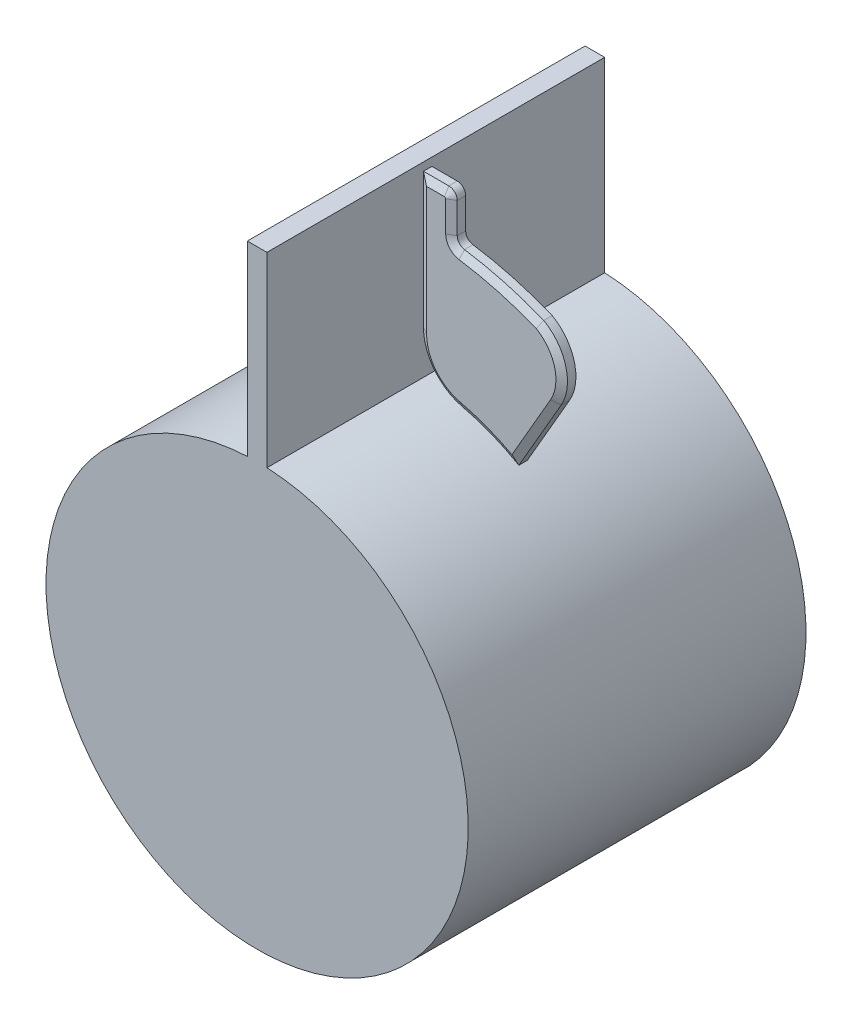
ISO-10303-21;
HEADER;
FILE_DESCRIPTION(('STEP AP214'),'2;1');
FILE_NAME('part.step','',(''),(''),'','','');
FILE_SCHEMA(('AUTOMOTIVE_DESIGN { 1 0 10303 214 1 1 1 1 }'));
ENDSEC;
DATA;
#1=APPLICATION_CONTEXT('core data for automotive mechanical design processes');
#2=APPLICATION_PROTOCOL_DEFINITION('international standard','automotive_design',2000,#1);
#3=PRODUCT_CONTEXT('',#1,'mechanical');
#4=PRODUCT('Part','Part','',(#3));
#5=PRODUCT_RELATED_PRODUCT_CATEGORY('part','',(#4));
#6=PRODUCT_DEFINITION_FORMATION('','',#4);
#7=PRODUCT_DEFINITION_CONTEXT('part definition',#1,'design');
#8=PRODUCT_DEFINITION('design','',#6,#7);
#9=PRODUCT_DEFINITION_SHAPE('','',#8);
#10=(LENGTH_UNIT() NAMED_UNIT(*) SI_UNIT(.MILLI.,.METRE.));
#11=(NAMED_UNIT(*) PLANE_ANGLE_UNIT() SI_UNIT($,.RADIAN.));
#12=(NAMED_UNIT(*) SI_UNIT($,.STERADIAN.) SOLID_ANGLE_UNIT());
#13=UNCERTAINTY_MEASURE_WITH_UNIT(LENGTH_MEASURE(1.E-05),#10,'distance_accuracy_value','');
#14=(GEOMETRIC_REPRESENTATION_CONTEXT(3) GLOBAL_UNCERTAINTY_ASSIGNED_CONTEXT((#13)) GLOBAL_UNIT_ASSIGNED_CONTEXT((#10,
#11,#12)) REPRESENTATION_CONTEXT('',''));
#15=CARTESIAN_POINT('',(0.,0.,0.));
#16=DIRECTION('',(0.,0.,1.));
#17=DIRECTION('',(1.,0.,0.));
#18=AXIS2_PLACEMENT_3D('',#15,#16,#17);
#19=CARTESIAN_POINT('',(0.,0.,63.5));
#20=DIRECTION('',(0.,0.,-1.));
#21=DIRECTION('',(-1.,0.,0.));
#22=AXIS2_PLACEMENT_3D('',#19,#20,#21);
#23=CYLINDRICAL_SURFACE('',#22,79.375);
#24=CARTESIAN_POINT('',(0.,0.,-63.5));
#25=DIRECTION('',(0.,0.,1.));
#26=DIRECTION('',(1.,0.,0.));
#27=AXIS2_PLACEMENT_3D('',#24,#25,#26);
#28=CIRCLE('',#27,79.375);
#29=CARTESIAN_POINT('',(-3.68299999999999,79.289508360186,-63.5));
#30=VERTEX_POINT('',#29);
#31=CARTESIAN_POINT('',(3.68300000000003,79.289508360186,-63.5));
#32=VERTEX_POINT('',#31);
#33=EDGE_CURVE('E122',#30,#32,#28,.T.);
#34=ORIENTED_EDGE('',*,*,#33,.T.);
#35=DIRECTION('',(0.,0.,-1.));
#36=VECTOR('',#35,1.);
#37=CARTESIAN_POINT('',(3.68300000000003,79.289508360186,63.5));
#38=LINE('',#37,#36);
#39=CARTESIAN_POINT('',(3.68300000000003,79.289508360186,63.5));
#40=VERTEX_POINT('',#39);
#41=EDGE_CURVE('E12',#40,#32,#38,.T.);
#42=ORIENTED_EDGE('',*,*,#41,.F.);
#43=CARTESIAN_POINT('',(0.,0.,63.5));
#44=DIRECTION('',(0.,0.,1.));
#45=DIRECTION('',(1.,0.,0.));
#46=AXIS2_PLACEMENT_3D('',#43,#44,#45);
#47=CIRCLE('',#46,79.375);
#48=CARTESIAN_POINT('',(-3.68299999999999,79.289508360186,63.5));
#49=VERTEX_POINT('',#48);
#50=EDGE_CURVE('E110',#49,#40,#47,.T.);
#51=ORIENTED_EDGE('',*,*,#50,.F.);
#52=DIRECTION('',(0.,0.,-1.));
#53=VECTOR('',#52,1.);
#54=CARTESIAN_POINT('',(-3.68299999999999,79.289508360186,63.5));
#55=LINE('',#54,#53);
#56=EDGE_CURVE('E118',#49,#30,#55,.T.);
#57=ORIENTED_EDGE('',*,*,#56,.T.);
#58=EDGE_LOOP('',(#34,#42,#51,#57));
#59=FACE_BOUND('',#58,.T.);
#60=ADVANCED_FACE('F59',(#59),#23,.T.);
#61=CARTESIAN_POINT('',(3.683,149.441811306485,63.5));
#62=DIRECTION('',(-1.,0.,0.));
#63=DIRECTION('',(0.,-1.,0.));
#64=AXIS2_PLACEMENT_3D('',#61,#62,#63);
#65=PLANE('',#64);
#66=DIRECTION('',(0.,1.,0.));
#67=VECTOR('',#66,1.);
#68=CARTESIAN_POINT('',(3.683,149.441811306485,-63.5));
#69=LINE('',#68,#67);
#70=CARTESIAN_POINT('',(3.683,149.441811306485,-63.5));
#71=VERTEX_POINT('',#70);
#72=EDGE_CURVE('E114',#32,#71,#69,.T.);
#73=ORIENTED_EDGE('',*,*,#72,.T.);
#74=DIRECTION('',(0.,0.,-1.));
#75=VECTOR('',#74,1.);
#76=CARTESIAN_POINT('',(3.683,149.441811306485,63.5));
#77=LINE('',#76,#75);
#78=CARTESIAN_POINT('',(3.683,149.441811306485,63.5));
#79=VERTEX_POINT('',#78);
#80=EDGE_CURVE('E67',#79,#71,#77,.T.);
#81=ORIENTED_EDGE('',*,*,#80,.F.);
#82=DIRECTION('',(0.,1.,0.));
#83=VECTOR('',#82,1.);
#84=CARTESIAN_POINT('',(3.683,149.441811306485,63.5));
#85=LINE('',#84,#83);
#86=EDGE_CURVE('E105',#40,#79,#85,.T.);
#87=ORIENTED_EDGE('',*,*,#86,.F.);
#88=ORIENTED_EDGE('',*,*,#41,.T.);
#89=EDGE_LOOP('',(#73,#81,#87,#88));
#90=FACE_BOUND('',#89,.T.);
#91=ADVANCED_FACE('F113',(#90),#65,.F.);
#92=CARTESIAN_POINT('',(3.683,149.441811306485,63.5));
#93=DIRECTION('',(0.,-1.,0.));
#94=DIRECTION('',(0.,0.,-1.));
#95=AXIS2_PLACEMENT_3D('',#92,#93,#94);
#96=PLANE('',#95);
#97=DIRECTION('',(-1.,0.,0.));
#98=VECTOR('',#97,1.);
#99=CARTESIAN_POINT('',(3.683,149.441811306485,-63.5));
#100=LINE('',#99,#98);
#101=CARTESIAN_POINT('',(-3.683,149.441811306485,-63.5));
#102=VERTEX_POINT('',#101);
#103=EDGE_CURVE('E92',#71,#102,#100,.T.);
#104=ORIENTED_EDGE('',*,*,#103,.T.);
#105=DIRECTION('',(0.,0.,-1.));
#106=VECTOR('',#105,1.);
#107=CARTESIAN_POINT('',(-3.683,149.441811306485,63.5));
#108=LINE('',#107,#106);
#109=CARTESIAN_POINT('',(-3.683,149.441811306485,63.5));
#110=VERTEX_POINT('',#109);
#111=EDGE_CURVE('E115',#110,#102,#108,.T.);
#112=ORIENTED_EDGE('',*,*,#111,.F.);
#113=DIRECTION('',(-1.,0.,0.));
#114=VECTOR('',#113,1.);
#115=CARTESIAN_POINT('',(3.683,149.441811306485,63.5));
#116=LINE('',#115,#114);
#117=EDGE_CURVE('E108',#79,#110,#116,.T.);
#118=ORIENTED_EDGE('',*,*,#117,.F.);
#119=ORIENTED_EDGE('',*,*,#80,.T.);
#120=EDGE_LOOP('',(#104,#112,#118,#119));
#121=FACE_BOUND('',#120,.T.);
#122=ADVANCED_FACE('F116',(#121),#96,.F.);
#123=CARTESIAN_POINT('',(-3.683,149.441811306485,63.5));
#124=DIRECTION('',(1.,0.,0.));
#125=DIRECTION('',(0.,1.,0.));
#126=AXIS2_PLACEMENT_3D('',#123,#124,#125);
#127=PLANE('',#126);
#128=DIRECTION('',(0.,-1.,0.));
#129=VECTOR('',#128,1.);
#130=CARTESIAN_POINT('',(-3.683,149.441811306485,-63.5));
#131=LINE('',#130,#129);
#132=EDGE_CURVE('E98',#102,#30,#131,.T.);
#133=ORIENTED_EDGE('',*,*,#132,.T.);
#134=ORIENTED_EDGE('',*,*,#56,.F.);
#135=DIRECTION('',(0.,-1.,0.));
#136=VECTOR('',#135,1.);
#137=CARTESIAN_POINT('',(-3.683,149.441811306485,63.5));
#138=LINE('',#137,#136);
#139=EDGE_CURVE('E75',#110,#49,#138,.T.);
#140=ORIENTED_EDGE('',*,*,#139,.F.);
#141=ORIENTED_EDGE('',*,*,#111,.T.);
#142=EDGE_LOOP('',(#133,#134,#140,#141));
#143=FACE_BOUND('',#142,.T.);
#144=ADVANCED_FACE('F129',(#143),#127,.F.);
#145=CARTESIAN_POINT('',(0.,0.,63.5));
#146=DIRECTION('',(0.,0.,1.));
#147=DIRECTION('',(1.,0.,0.));
#148=AXIS2_PLACEMENT_3D('',#145,#146,#147);
#149=PLANE('',#148);
#150=ORIENTED_EDGE('',*,*,#50,.T.);
#151=ORIENTED_EDGE('',*,*,#86,.T.);
#152=ORIENTED_EDGE('',*,*,#117,.T.);
#153=ORIENTED_EDGE('',*,*,#139,.T.);
#154=EDGE_LOOP('',(#150,#151,#152,#153));
#155=FACE_BOUND('',#154,.T.);
#156=ADVANCED_FACE('F106',(#155),#149,.T.);
#157=CARTESIAN_POINT('',(0.,0.,-63.5));
#158=DIRECTION('',(0.,0.,1.));
#159=DIRECTION('',(1.,0.,0.));
#160=AXIS2_PLACEMENT_3D('',#157,#158,#159);
#161=PLANE('',#160);
#162=ORIENTED_EDGE('',*,*,#33,.F.);
#163=ORIENTED_EDGE('',*,*,#132,.F.);
#164=ORIENTED_EDGE('',*,*,#103,.F.);
#165=ORIENTED_EDGE('',*,*,#72,.F.);
#166=EDGE_LOOP('',(#162,#163,#164,#165));
#167=FACE_BOUND('',#166,.T.);
#168=ADVANCED_FACE('F132',(#167),#161,.F.);
#169=CLOSED_SHELL('',(#60,#91,#122,#144,#156,#168));
#170=MANIFOLD_SOLID_BREP('B2_NOT_SHOWN',#169);
#171=CARTESIAN_POINT('',(0.,0.,6.35));
#172=DIRECTION('',(-0.866025403784442,0.499999999999994,0.));
#173=DIRECTION('',(-0.499999999999994,-0.866025403784442,0.));
#174=AXIS2_PLACEMENT_3D('',#171,#172,#173);
#175=PLANE('',#174);
#176=DIRECTION('',(0.,0.,-1.));
#177=VECTOR('',#176,1.);
#178=CARTESIAN_POINT('',(39.6874999999995,68.7407664253901,6.35));
#179=LINE('',#178,#177);
#180=CARTESIAN_POINT('',(39.6874999999995,68.7407664253901,4.76249964031978));
#181=VERTEX_POINT('',#180);
#182=CARTESIAN_POINT('',(39.6874999999995,68.7407664253901,1.58750035968022));
#183=VERTEX_POINT('',#182);
#184=EDGE_CURVE('E469',#181,#183,#179,.T.);
#185=ORIENTED_EDGE('',*,*,#184,.T.);
#186=DIRECTION('',(0.499999999999994,0.866025403784442,0.));
#187=VECTOR('',#186,1.);
#188=CARTESIAN_POINT('',(0.,0.,1.58750035968022));
#189=LINE('',#188,#187);
#190=CARTESIAN_POINT('',(55.5624999999993,96.2370729955462,1.58750035968022));
#191=VERTEX_POINT('',#190);
#192=EDGE_CURVE('E57',#183,#191,#189,.T.);
#193=ORIENTED_EDGE('',*,*,#192,.T.);
#194=DIRECTION('',(0.,0.,-1.));
#195=VECTOR('',#194,1.);
#196=CARTESIAN_POINT('',(55.5624999999993,96.2370729955462,6.35));
#197=LINE('',#196,#195);
#198=CARTESIAN_POINT('',(55.5624999999993,96.2370729955462,4.76249964031978));
#199=VERTEX_POINT('',#198);
#200=EDGE_CURVE('E359',#199,#191,#197,.T.);
#201=ORIENTED_EDGE('',*,*,#200,.F.);
#202=DIRECTION('',(-0.499999999999994,-0.866025403784442,0.));
#203=VECTOR('',#202,1.);
#204=CARTESIAN_POINT('',(39.6874999999995,68.7407664253901,4.76249964031978));
#205=LINE('',#204,#203);
#206=EDGE_CURVE('E398',#199,#181,#205,.T.);
#207=ORIENTED_EDGE('',*,*,#206,.T.);
#208=EDGE_LOOP('',(#185,#193,#201,#207));
#209=FACE_BOUND('',#208,.T.);
#210=ADVANCED_FACE('F195',(#209),#175,.F.);
#211=CARTESIAN_POINT('',(40.1264896133241,105.149057747507,6.35));
#212=DIRECTION('',(0.,0.,-1.));
#213=DIRECTION('',(-1.,0.,0.));
#214=AXIS2_PLACEMENT_3D('',#211,#212,#213);
#215=CYLINDRICAL_SURFACE('',#214,17.8239695039215);
#216=ORIENTED_EDGE('',*,*,#200,.T.);
#217=CARTESIAN_POINT('',(40.1264896133241,105.149057747507,1.58750035968021));
#218=DIRECTION('',(0.,0.,1.));
#219=DIRECTION('',(1.,0.,0.));
#220=AXIS2_PLACEMENT_3D('',#217,#218,#219);
#221=CIRCLE('',#220,17.8239695039215);
#222=CARTESIAN_POINT('',(49.0384743652847,120.585068134182,1.58750035968021));
#223=VERTEX_POINT('',#222);
#224=EDGE_CURVE('E400',#191,#223,#221,.T.);
#225=ORIENTED_EDGE('',*,*,#224,.T.);
#226=DIRECTION('',(0.,0.,-1.));
#227=VECTOR('',#226,1.);
#228=CARTESIAN_POINT('',(49.0384743652847,120.585068134182,6.35));
#229=LINE('',#228,#227);
#230=CARTESIAN_POINT('',(49.0384743652847,120.585068134182,4.76249964031978));
#231=VERTEX_POINT('',#230);
#232=EDGE_CURVE('E628',#231,#223,#229,.T.);
#233=ORIENTED_EDGE('',*,*,#232,.F.);
#234=CARTESIAN_POINT('',(40.1264896133241,105.149057747507,4.76249964031978));
#235=DIRECTION('',(0.,0.,1.));
#236=DIRECTION('',(1.,0.,0.));
#237=AXIS2_PLACEMENT_3D('',#234,#235,#236);
#238=CIRCLE('',#237,17.8239695039215);
#239=EDGE_CURVE('E395',#231,#199,#238,.F.);
#240=ORIENTED_EDGE('',*,*,#239,.T.);
#241=EDGE_LOOP('',(#216,#225,#233,#240));
#242=FACE_BOUND('',#241,.T.);
#243=ADVANCED_FACE('F623',(#242),#215,.T.);
#244=CARTESIAN_POINT('',(0.,0.,6.35));
#245=DIRECTION('',(0.,0.,-1.));
#246=DIRECTION('',(-1.,0.,0.));
#247=AXIS2_PLACEMENT_3D('',#244,#245,#246);
#248=CYLINDRICAL_SURFACE('',#247,130.175);
#249=ORIENTED_EDGE('',*,*,#232,.T.);
#250=CARTESIAN_POINT('',(0.,0.,1.58750035968021));
#251=DIRECTION('',(0.,0.,1.));
#252=DIRECTION('',(1.,0.,0.));
#253=AXIS2_PLACEMENT_3D('',#250,#251,#252);
#254=CIRCLE('',#253,130.175);
#255=CARTESIAN_POINT('',(19.2163095238095,128.748841056085,1.58750035968021));
#256=VERTEX_POINT('',#255);
#257=EDGE_CURVE('E504',#223,#256,#254,.T.);
#258=ORIENTED_EDGE('',*,*,#257,.T.);
#259=DIRECTION('',(0.,0.,-1.));
#260=VECTOR('',#259,1.);
#261=CARTESIAN_POINT('',(19.2163095238095,128.748841056085,6.35));
#262=LINE('',#261,#260);
#263=CARTESIAN_POINT('',(19.2163095238095,128.748841056085,4.76249964031978));
#264=VERTEX_POINT('',#263);
#265=EDGE_CURVE('E631',#264,#256,#262,.T.);
#266=ORIENTED_EDGE('',*,*,#265,.F.);
#267=CARTESIAN_POINT('',(0.,0.,4.76249964031978));
#268=DIRECTION('',(0.,0.,1.));
#269=DIRECTION('',(1.,0.,0.));
#270=AXIS2_PLACEMENT_3D('',#267,#268,#269);
#271=CIRCLE('',#270,130.175);
#272=EDGE_CURVE('E392',#264,#231,#271,.F.);
#273=ORIENTED_EDGE('',*,*,#272,.T.);
#274=EDGE_LOOP('',(#249,#258,#266,#273));
#275=FACE_BOUND('',#274,.T.);
#276=ADVANCED_FACE('F734',(#275),#248,.T.);
#277=CARTESIAN_POINT('',(19.685,131.8890566916,6.35));
#278=DIRECTION('',(0.,0.,-1.));
#279=DIRECTION('',(-1.,0.,0.));
#280=AXIS2_PLACEMENT_3D('',#277,#278,#279);
#281=CYLINDRICAL_SURFACE('',#280,3.17500000000001);
#282=ORIENTED_EDGE('',*,*,#265,.T.);
#283=CARTESIAN_POINT('',(19.685,131.8890566916,1.58750035968021));
#284=DIRECTION('',(0.,0.,1.));
#285=DIRECTION('',(1.,0.,0.));
#286=AXIS2_PLACEMENT_3D('',#283,#284,#285);
#287=CIRCLE('',#286,3.17500000000001);
#288=CARTESIAN_POINT('',(16.51,131.8890566916,1.58750035968021));
#289=VERTEX_POINT('',#288);
#290=EDGE_CURVE('E507',#256,#289,#287,.F.);
#291=ORIENTED_EDGE('',*,*,#290,.T.);
#292=DIRECTION('',(0.,0.,-1.));
#293=VECTOR('',#292,1.);
#294=CARTESIAN_POINT('',(16.51,131.8890566916,6.35));
#295=LINE('',#294,#293);
#296=CARTESIAN_POINT('',(16.51,131.8890566916,4.76249964031978));
#297=VERTEX_POINT('',#296);
#298=EDGE_CURVE('E683',#297,#289,#295,.T.);
#299=ORIENTED_EDGE('',*,*,#298,.F.);
#300=CARTESIAN_POINT('',(19.685,131.8890566916,4.76249964031978));
#301=DIRECTION('',(0.,0.,1.));
#302=DIRECTION('',(1.,0.,0.));
#303=AXIS2_PLACEMENT_3D('',#300,#301,#302);
#304=CIRCLE('',#303,3.17500000000001);
#305=EDGE_CURVE('E389',#297,#264,#304,.T.);
#306=ORIENTED_EDGE('',*,*,#305,.T.);
#307=EDGE_LOOP('',(#282,#291,#299,#306));
#308=FACE_BOUND('',#307,.T.);
#309=ADVANCED_FACE('F692',(#308),#281,.F.);
#310=CARTESIAN_POINT('',(16.51,0.,6.35));
#311=DIRECTION('',(-1.,0.,0.));
#312=DIRECTION('',(0.,0.,1.));
#313=AXIS2_PLACEMENT_3D('',#310,#311,#312);
#314=PLANE('',#313);
#315=ORIENTED_EDGE('',*,*,#298,.T.);
#316=DIRECTION('',(0.,1.,0.));
#317=VECTOR('',#316,1.);
#318=CARTESIAN_POINT('',(16.51,0.,1.58750035968021));
#319=LINE('',#318,#317);
#320=CARTESIAN_POINT('',(16.51,143.358489568698,1.58750035968021));
#321=VERTEX_POINT('',#320);
#322=EDGE_CURVE('E510',#289,#321,#319,.T.);
#323=ORIENTED_EDGE('',*,*,#322,.T.);
#324=DIRECTION('',(0.,0.,-1.));
#325=VECTOR('',#324,1.);
#326=CARTESIAN_POINT('',(16.51,143.358489568698,6.35));
#327=LINE('',#326,#325);
#328=CARTESIAN_POINT('',(16.51,143.358489568698,4.76249964031978));
#329=VERTEX_POINT('',#328);
#330=EDGE_CURVE('E679',#329,#321,#327,.T.);
#331=ORIENTED_EDGE('',*,*,#330,.F.);
#332=DIRECTION('',(0.,-1.,0.));
#333=VECTOR('',#332,1.);
#334=CARTESIAN_POINT('',(16.51,131.8890566916,4.76249964031978));
#335=LINE('',#334,#333);
#336=EDGE_CURVE('E386',#329,#297,#335,.T.);
#337=ORIENTED_EDGE('',*,*,#336,.T.);
#338=EDGE_LOOP('',(#315,#323,#331,#337));
#339=FACE_BOUND('',#338,.T.);
#340=ADVANCED_FACE('F715',(#339),#314,.F.);
#341=CARTESIAN_POINT('',(13.335,143.358489568698,6.35));
#342=DIRECTION('',(0.,0.,-1.));
#343=DIRECTION('',(-1.,0.,0.));
#344=AXIS2_PLACEMENT_3D('',#341,#342,#343);
#345=CYLINDRICAL_SURFACE('',#344,3.17500000000001);
#346=ORIENTED_EDGE('',*,*,#330,.T.);
#347=CARTESIAN_POINT('',(13.335,143.358489568698,1.58750035968021));
#348=DIRECTION('',(0.,0.,1.));
#349=DIRECTION('',(1.,0.,0.));
#350=AXIS2_PLACEMENT_3D('',#347,#348,#349);
#351=CIRCLE('',#350,3.17500000000001);
#352=CARTESIAN_POINT('',(13.335,146.533489568698,1.58750035968021));
#353=VERTEX_POINT('',#352);
#354=EDGE_CURVE('E513',#321,#353,#351,.T.);
#355=ORIENTED_EDGE('',*,*,#354,.T.);
#356=DIRECTION('',(0.,0.,-1.));
#357=VECTOR('',#356,1.);
#358=CARTESIAN_POINT('',(13.335,146.533489568698,6.35));
#359=LINE('',#358,#357);
#360=CARTESIAN_POINT('',(13.335,146.533489568698,4.76249964031978));
#361=VERTEX_POINT('',#360);
#362=EDGE_CURVE('E675',#361,#353,#359,.T.);
#363=ORIENTED_EDGE('',*,*,#362,.F.);
#364=CARTESIAN_POINT('',(13.335,143.358489568698,4.76249964031978));
#365=DIRECTION('',(0.,0.,1.));
#366=DIRECTION('',(1.,0.,0.));
#367=AXIS2_PLACEMENT_3D('',#364,#365,#366);
#368=CIRCLE('',#367,3.17500000000001);
#369=EDGE_CURVE('E383',#361,#329,#368,.F.);
#370=ORIENTED_EDGE('',*,*,#369,.T.);
#371=EDGE_LOOP('',(#346,#355,#363,#370));
#372=FACE_BOUND('',#371,.T.);
#373=ADVANCED_FACE('F718',(#372),#345,.T.);
#374=CARTESIAN_POINT('',(0.,146.533489568698,6.35));
#375=DIRECTION('',(0.,1.,0.));
#376=DIRECTION('',(0.,0.,1.));
#377=AXIS2_PLACEMENT_3D('',#374,#375,#376);
#378=PLANE('',#377);
#379=ORIENTED_EDGE('',*,*,#362,.T.);
#380=DIRECTION('',(-1.,0.,0.));
#381=VECTOR('',#380,1.);
#382=CARTESIAN_POINT('',(3.81,146.533489568698,1.58750035968021));
#383=LINE('',#382,#381);
#384=CARTESIAN_POINT('',(3.81,146.533489568698,1.58750035968021));
#385=VERTEX_POINT('',#384);
#386=EDGE_CURVE('E516',#353,#385,#383,.T.);
#387=ORIENTED_EDGE('',*,*,#386,.T.);
#388=DIRECTION('',(0.,0.,-1.));
#389=VECTOR('',#388,1.);
#390=CARTESIAN_POINT('',(3.81,146.533489568698,6.35));
#391=LINE('',#390,#389);
#392=CARTESIAN_POINT('',(3.81,146.533489568698,4.76249964031978));
#393=VERTEX_POINT('',#392);
#394=EDGE_CURVE('E671',#393,#385,#391,.T.);
#395=ORIENTED_EDGE('',*,*,#394,.F.);
#396=DIRECTION('',(1.,0.,0.));
#397=VECTOR('',#396,1.);
#398=CARTESIAN_POINT('',(0.,146.533489568698,4.76249964031978));
#399=LINE('',#398,#397);
#400=EDGE_CURVE('E380',#393,#361,#399,.T.);
#401=ORIENTED_EDGE('',*,*,#400,.T.);
#402=EDGE_LOOP('',(#379,#387,#395,#401));
#403=FACE_BOUND('',#402,.T.);
#404=ADVANCED_FACE('F745',(#403),#378,.T.);
#405=CARTESIAN_POINT('',(3.81000000000002,0.,6.35));
#406=DIRECTION('',(1.,0.,0.));
#407=DIRECTION('',(0.,1.,0.));
#408=AXIS2_PLACEMENT_3D('',#405,#406,#407);
#409=PLANE('',#408);
#410=ORIENTED_EDGE('',*,*,#394,.T.);
#411=DIRECTION('',(0.,-1.,0.));
#412=VECTOR('',#411,1.);
#413=CARTESIAN_POINT('',(3.81000000000002,0.,1.58750035968021));
#414=LINE('',#413,#412);
#415=CARTESIAN_POINT('',(3.81000000000001,95.7334895686979,1.58750035968021));
#416=VERTEX_POINT('',#415);
#417=EDGE_CURVE('E519',#385,#416,#414,.T.);
#418=ORIENTED_EDGE('',*,*,#417,.T.);
#419=DIRECTION('',(0.,0.,-1.));
#420=VECTOR('',#419,1.);
#421=CARTESIAN_POINT('',(3.81000000000001,95.7334895686979,6.35));
#422=LINE('',#421,#420);
#423=CARTESIAN_POINT('',(3.81000000000001,95.7334895686979,4.76249964031978));
#424=VERTEX_POINT('',#423);
#425=EDGE_CURVE('E668',#424,#416,#422,.T.);
#426=ORIENTED_EDGE('',*,*,#425,.F.);
#427=DIRECTION('',(0.,1.,0.));
#428=VECTOR('',#427,1.);
#429=CARTESIAN_POINT('',(3.81,146.533489568698,4.76249964031978));
#430=LINE('',#429,#428);
#431=EDGE_CURVE('E377',#424,#393,#430,.T.);
#432=ORIENTED_EDGE('',*,*,#431,.T.);
#433=EDGE_LOOP('',(#410,#418,#426,#432));
#434=FACE_BOUND('',#433,.T.);
#435=ADVANCED_FACE('F748',(#434),#409,.F.);
#436=CARTESIAN_POINT('',(22.86,95.7334895686979,6.35));
#437=DIRECTION('',(0.,0.,-1.));
#438=DIRECTION('',(-1.,0.,0.));
#439=AXIS2_PLACEMENT_3D('',#436,#437,#438);
#440=CYLINDRICAL_SURFACE('',#439,19.05);
#441=ORIENTED_EDGE('',*,*,#425,.T.);
#442=CARTESIAN_POINT('',(22.86,95.7334895686979,1.58750035968021));
#443=DIRECTION('',(0.,0.,1.));
#444=DIRECTION('',(1.,0.,0.));
#445=AXIS2_PLACEMENT_3D('',#442,#443,#444);
#446=CIRCLE('',#445,19.05);
#447=CARTESIAN_POINT('',(18.4354838709678,77.2044270715306,1.58750035968021));
#448=VERTEX_POINT('',#447);
#449=EDGE_CURVE('E221',#416,#448,#446,.T.);
#450=ORIENTED_EDGE('',*,*,#449,.T.);
#451=DIRECTION('',(0.,0.,-1.));
#452=VECTOR('',#451,1.);
#453=CARTESIAN_POINT('',(18.4354838709678,77.2044270715306,6.35));
#454=LINE('',#453,#452);
#455=CARTESIAN_POINT('',(18.4354838709678,77.2044270715306,4.76249964031978));
#456=VERTEX_POINT('',#455);
#457=EDGE_CURVE('E665',#456,#448,#454,.T.);
#458=ORIENTED_EDGE('',*,*,#457,.F.);
#459=CARTESIAN_POINT('',(22.86,95.7334895686979,4.76249964031978));
#460=DIRECTION('',(0.,0.,1.));
#461=DIRECTION('',(1.,0.,0.));
#462=AXIS2_PLACEMENT_3D('',#459,#460,#461);
#463=CIRCLE('',#462,19.05);
#464=EDGE_CURVE('E369',#456,#424,#463,.F.);
#465=ORIENTED_EDGE('',*,*,#464,.T.);
#466=EDGE_LOOP('',(#441,#450,#458,#465));
#467=FACE_BOUND('',#466,.T.);
#468=ADVANCED_FACE('F752',(#467),#440,.T.);
#469=CARTESIAN_POINT('',(0.,0.,6.35));
#470=DIRECTION('',(0.,0.,-1.));
#471=DIRECTION('',(-1.,0.,0.));
#472=AXIS2_PLACEMENT_3D('',#469,#470,#471);
#473=CYLINDRICAL_SURFACE('',#472,79.375);
#474=ORIENTED_EDGE('',*,*,#457,.T.);
#475=CARTESIAN_POINT('',(0.,0.,1.58750035968021));
#476=DIRECTION('',(0.,0.,1.));
#477=DIRECTION('',(1.,0.,0.));
#478=AXIS2_PLACEMENT_3D('',#475,#476,#477);
#479=CIRCLE('',#478,79.375);
#480=EDGE_CURVE('E206',#448,#183,#479,.F.);
#481=ORIENTED_EDGE('',*,*,#480,.T.);
#482=ORIENTED_EDGE('',*,*,#184,.F.);
#483=CARTESIAN_POINT('',(0.,0.,4.76249964031978));
#484=DIRECTION('',(0.,0.,1.));
#485=DIRECTION('',(1.,0.,0.));
#486=AXIS2_PLACEMENT_3D('',#483,#484,#485);
#487=CIRCLE('',#486,79.375);
#488=EDGE_CURVE('E344',#181,#456,#487,.T.);
#489=ORIENTED_EDGE('',*,*,#488,.T.);
#490=EDGE_LOOP('',(#474,#481,#482,#489));
#491=FACE_BOUND('',#490,.T.);
#492=ADVANCED_FACE('F756',(#491),#473,.F.);
#493=CARTESIAN_POINT('',(0.,0.,6.35));
#494=DIRECTION('',(0.,0.,1.));
#495=DIRECTION('',(1.,0.,0.));
#496=AXIS2_PLACEMENT_3D('',#493,#494,#495);
#497=PLANE('',#496);
#498=CARTESIAN_POINT('',(22.86,95.7334895686979,6.35));
#499=DIRECTION('',(0.,0.,1.));
#500=DIRECTION('',(1.,0.,0.));
#501=AXIS2_PLACEMENT_3D('',#498,#499,#500);
#502=CIRCLE('',#501,16.30036872);
#503=CARTESIAN_POINT('',(6.55963128000003,95.7334895686979,6.35));
#504=VERTEX_POINT('',#503);
#505=CARTESIAN_POINT('',(19.0741079101936,79.8788674826218,6.35));
#506=VERTEX_POINT('',#505);
#507=EDGE_CURVE('E363',#504,#506,#502,.T.);
#508=ORIENTED_EDGE('',*,*,#507,.T.);
#509=CARTESIAN_POINT('',(0.,0.,6.35));
#510=DIRECTION('',(0.,0.,1.));
#511=DIRECTION('',(1.,0.,0.));
#512=AXIS2_PLACEMENT_3D('',#509,#510,#511);
#513=CIRCLE('',#512,82.12463128);
#514=CARTESIAN_POINT('',(38.6580434075612,72.4569578631002,6.35));
#515=VERTEX_POINT('',#514);
#516=EDGE_CURVE('E342',#506,#515,#513,.F.);
#517=ORIENTED_EDGE('',*,*,#516,.T.);
#518=DIRECTION('',(0.499999999999994,0.866025403784442,0.));
#519=VECTOR('',#518,1.);
#520=CARTESIAN_POINT('',(53.181249460479,97.6118886355461,6.35));
#521=LINE('',#520,#519);
#522=CARTESIAN_POINT('',(53.181249460479,97.6118886355462,6.35));
#523=VERTEX_POINT('',#522);
#524=EDGE_CURVE('E351',#515,#523,#521,.T.);
#525=ORIENTED_EDGE('',*,*,#524,.T.);
#526=CARTESIAN_POINT('',(40.1264896133241,105.149057747507,6.35));
#527=DIRECTION('',(0.,0.,1.));
#528=DIRECTION('',(1.,0.,0.));
#529=AXIS2_PLACEMENT_3D('',#526,#527,#528);
#530=CIRCLE('',#529,15.0743382239215);
#531=CARTESIAN_POINT('',(47.8209536101816,118.111730955231,6.35));
#532=VERTEX_POINT('',#531);
#533=EDGE_CURVE('E358',#523,#532,#530,.T.);
#534=ORIENTED_EDGE('',*,*,#533,.T.);
#535=CARTESIAN_POINT('',(0.,0.,6.35));
#536=DIRECTION('',(0.,0.,1.));
#537=DIRECTION('',(1.,0.,0.));
#538=AXIS2_PLACEMENT_3D('',#535,#536,#537);
#539=CIRCLE('',#538,127.42536872);
#540=CARTESIAN_POINT('',(18.8104115729524,126.02933392621,6.35));
#541=VERTEX_POINT('',#540);
#542=EDGE_CURVE('E637',#532,#541,#539,.T.);
#543=ORIENTED_EDGE('',*,*,#542,.T.);
#544=CARTESIAN_POINT('',(19.685,131.8890566916,6.35));
#545=DIRECTION('',(0.,0.,1.));
#546=DIRECTION('',(1.,0.,0.));
#547=AXIS2_PLACEMENT_3D('',#544,#545,#546);
#548=CIRCLE('',#547,5.92463128000004);
#549=CARTESIAN_POINT('',(13.76036872,131.8890566916,6.35));
#550=VERTEX_POINT('',#549);
#551=EDGE_CURVE('E640',#541,#550,#548,.F.);
#552=ORIENTED_EDGE('',*,*,#551,.T.);
#553=DIRECTION('',(0.,1.,0.));
#554=VECTOR('',#553,1.);
#555=CARTESIAN_POINT('',(13.76036872,143.358489568698,6.35));
#556=LINE('',#555,#554);
#557=CARTESIAN_POINT('',(13.76036872,143.358489568698,6.35));
#558=VERTEX_POINT('',#557);
#559=EDGE_CURVE('E643',#550,#558,#556,.T.);
#560=ORIENTED_EDGE('',*,*,#559,.T.);
#561=CARTESIAN_POINT('',(13.335,143.358489568698,6.35));
#562=DIRECTION('',(0.,0.,1.));
#563=DIRECTION('',(1.,0.,0.));
#564=AXIS2_PLACEMENT_3D('',#561,#562,#563);
#565=CIRCLE('',#564,0.425368719999986);
#566=CARTESIAN_POINT('',(13.335,143.783858288698,6.35));
#567=VERTEX_POINT('',#566);
#568=EDGE_CURVE('E646',#558,#567,#565,.T.);
#569=ORIENTED_EDGE('',*,*,#568,.T.);
#570=DIRECTION('',(-1.,0.,0.));
#571=VECTOR('',#570,1.);
#572=CARTESIAN_POINT('',(0.,143.783858288698,6.35));
#573=LINE('',#572,#571);
#574=CARTESIAN_POINT('',(6.55963128000003,143.783858288698,6.35));
#575=VERTEX_POINT('',#574);
#576=EDGE_CURVE('E649',#567,#575,#573,.T.);
#577=ORIENTED_EDGE('',*,*,#576,.T.);
#578=DIRECTION('',(0.,-1.,0.));
#579=VECTOR('',#578,1.);
#580=CARTESIAN_POINT('',(6.55963128000003,95.7334895686979,6.35));
#581=LINE('',#580,#579);
#582=EDGE_CURVE('E371',#575,#504,#581,.T.);
#583=ORIENTED_EDGE('',*,*,#582,.T.);
#584=EDGE_LOOP('',(#508,#517,#525,#534,#543,#552,#560,#569,#577,#583));
#585=FACE_BOUND('',#584,.T.);
#586=ADVANCED_FACE('F361',(#585),#497,.T.);
#587=CARTESIAN_POINT('',(0.,0.,0.));
#588=DIRECTION('',(0.,0.,1.));
#589=DIRECTION('',(1.,0.,0.));
#590=AXIS2_PLACEMENT_3D('',#587,#588,#589);
#591=PLANE('',#590);
#592=CARTESIAN_POINT('',(0.,0.,0.));
#593=DIRECTION('',(0.,0.,1.));
#594=DIRECTION('',(1.,0.,0.));
#595=AXIS2_PLACEMENT_3D('',#592,#593,#594);
#596=CIRCLE('',#595,127.42536872);
#597=CARTESIAN_POINT('',(18.8104115729524,126.02933392621,0.));
#598=VERTEX_POINT('',#597);
#599=CARTESIAN_POINT('',(47.8209536101817,118.111730955231,0.));
#600=VERTEX_POINT('',#599);
#601=EDGE_CURVE('E497',#598,#600,#596,.F.);
#602=ORIENTED_EDGE('',*,*,#601,.T.);
#603=CARTESIAN_POINT('',(40.1264896133241,105.149057747507,0.));
#604=DIRECTION('',(0.,0.,1.));
#605=DIRECTION('',(1.,0.,0.));
#606=AXIS2_PLACEMENT_3D('',#603,#604,#605);
#607=CIRCLE('',#606,15.0743382239215);
#608=CARTESIAN_POINT('',(53.181249460479,97.6118886355461,0.));
#609=VERTEX_POINT('',#608);
#610=EDGE_CURVE('E500',#600,#609,#607,.F.);
#611=ORIENTED_EDGE('',*,*,#610,.T.);
#612=DIRECTION('',(-0.499999999999994,-0.866025403784442,0.));
#613=VECTOR('',#612,1.);
#614=CARTESIAN_POINT('',(-2.38125053952032,1.37481563999998,0.));
#615=LINE('',#614,#613);
#616=CARTESIAN_POINT('',(38.6580434075612,72.4569578631001,0.));
#617=VERTEX_POINT('',#616);
#618=EDGE_CURVE('E473',#609,#617,#615,.T.);
#619=ORIENTED_EDGE('',*,*,#618,.T.);
#620=CARTESIAN_POINT('',(0.,0.,0.));
#621=DIRECTION('',(0.,0.,1.));
#622=DIRECTION('',(1.,0.,0.));
#623=AXIS2_PLACEMENT_3D('',#620,#621,#622);
#624=CIRCLE('',#623,82.12463128);
#625=CARTESIAN_POINT('',(19.0741079101936,79.8788674826217,0.));
#626=VERTEX_POINT('',#625);
#627=EDGE_CURVE('E476',#617,#626,#624,.T.);
#628=ORIENTED_EDGE('',*,*,#627,.T.);
#629=CARTESIAN_POINT('',(22.86,95.7334895686979,0.));
#630=DIRECTION('',(0.,0.,1.));
#631=DIRECTION('',(1.,0.,0.));
#632=AXIS2_PLACEMENT_3D('',#629,#630,#631);
#633=CIRCLE('',#632,16.30036872);
#634=CARTESIAN_POINT('',(6.55963128000001,95.7334895686979,0.));
#635=VERTEX_POINT('',#634);
#636=EDGE_CURVE('E479',#626,#635,#633,.F.);
#637=ORIENTED_EDGE('',*,*,#636,.T.);
#638=DIRECTION('',(0.,1.,0.));
#639=VECTOR('',#638,1.);
#640=CARTESIAN_POINT('',(6.55963128000002,0.,0.));
#641=LINE('',#640,#639);
#642=CARTESIAN_POINT('',(6.55963128,143.783858288698,0.));
#643=VERTEX_POINT('',#642);
#644=EDGE_CURVE('E482',#635,#643,#641,.T.);
#645=ORIENTED_EDGE('',*,*,#644,.T.);
#646=DIRECTION('',(1.,0.,0.));
#647=VECTOR('',#646,1.);
#648=CARTESIAN_POINT('',(13.335,143.783858288698,0.));
#649=LINE('',#648,#647);
#650=CARTESIAN_POINT('',(13.335,143.783858288698,0.));
#651=VERTEX_POINT('',#650);
#652=EDGE_CURVE('E485',#643,#651,#649,.T.);
#653=ORIENTED_EDGE('',*,*,#652,.T.);
#654=CARTESIAN_POINT('',(13.335,143.358489568698,0.));
#655=DIRECTION('',(0.,0.,1.));
#656=DIRECTION('',(1.,0.,0.));
#657=AXIS2_PLACEMENT_3D('',#654,#655,#656);
#658=CIRCLE('',#657,0.425368720000005);
#659=CARTESIAN_POINT('',(13.76036872,143.358489568698,0.));
#660=VERTEX_POINT('',#659);
#661=EDGE_CURVE('E488',#651,#660,#658,.F.);
#662=ORIENTED_EDGE('',*,*,#661,.T.);
#663=DIRECTION('',(0.,-1.,0.));
#664=VECTOR('',#663,1.);
#665=CARTESIAN_POINT('',(13.76036872,0.,0.));
#666=LINE('',#665,#664);
#667=CARTESIAN_POINT('',(13.76036872,131.8890566916,0.));
#668=VERTEX_POINT('',#667);
#669=EDGE_CURVE('E491',#660,#668,#666,.T.);
#670=ORIENTED_EDGE('',*,*,#669,.T.);
#671=CARTESIAN_POINT('',(19.685,131.8890566916,0.));
#672=DIRECTION('',(0.,0.,1.));
#673=DIRECTION('',(1.,0.,0.));
#674=AXIS2_PLACEMENT_3D('',#671,#672,#673);
#675=CIRCLE('',#674,5.92463128000001);
#676=EDGE_CURVE('E494',#668,#598,#675,.T.);
#677=ORIENTED_EDGE('',*,*,#676,.T.);
#678=EDGE_LOOP('',(#602,#611,#619,#628,#637,#645,#653,#662,#670,#677));
#679=FACE_BOUND('',#678,.T.);
#680=ADVANCED_FACE('F606',(#679),#591,.F.);
#681=CARTESIAN_POINT('',(13.76036872,0.,6.35));
#682=DIRECTION('',(0.499999999999998,0.,0.86602540378444));
#683=DIRECTION('',(0.,-1.,0.));
#684=AXIS2_PLACEMENT_3D('',#681,#682,#683);
#685=PLANE('',#684);
#686=DIRECTION('',(-0.86602540378444,0.,0.499999999999998));
#687=VECTOR('',#686,1.);
#688=CARTESIAN_POINT('',(16.51,131.8890566916,4.76249964031978));
#689=LINE('',#688,#687);
#690=EDGE_CURVE('E461',#297,#550,#689,.T.);
#691=ORIENTED_EDGE('',*,*,#690,.F.);
#692=ORIENTED_EDGE('',*,*,#336,.F.);
#693=DIRECTION('',(0.86602540378444,0.,-0.499999999999998));
#694=VECTOR('',#693,1.);
#695=CARTESIAN_POINT('',(13.76036872,143.358489568698,6.35));
#696=LINE('',#695,#694);
#697=EDGE_CURVE('E465',#558,#329,#696,.T.);
#698=ORIENTED_EDGE('',*,*,#697,.F.);
#699=ORIENTED_EDGE('',*,*,#559,.F.);
#700=EDGE_LOOP('',(#691,#692,#698,#699));
#701=FACE_BOUND('',#700,.T.);
#702=ADVANCED_FACE('F761',(#701),#685,.T.);
#703=CARTESIAN_POINT('',(13.335,143.358489568698,4.76249964031978));
#704=DIRECTION('',(0.,0.,-1.));
#705=DIRECTION('',(-1.,0.,0.));
#706=AXIS2_PLACEMENT_3D('',#703,#704,#705);
#707=CONICAL_SURFACE('',#706,3.17500000000001,1.0471975511966);
#708=ORIENTED_EDGE('',*,*,#697,.T.);
#709=ORIENTED_EDGE('',*,*,#369,.F.);
#710=DIRECTION('',(0.,0.86602540378444,-0.499999999999998));
#711=VECTOR('',#710,1.);
#712=CARTESIAN_POINT('',(13.335,143.783858288698,6.35));
#713=LINE('',#712,#711);
#714=EDGE_CURVE('E457',#567,#361,#713,.T.);
#715=ORIENTED_EDGE('',*,*,#714,.F.);
#716=ORIENTED_EDGE('',*,*,#568,.F.);
#717=EDGE_LOOP('',(#708,#709,#715,#716));
#718=FACE_BOUND('',#717,.T.);
#719=ADVANCED_FACE('F778',(#718),#707,.T.);
#720=CARTESIAN_POINT('',(19.685,131.8890566916,6.35));
#721=DIRECTION('',(0.,0.,1.));
#722=DIRECTION('',(1.,0.,0.));
#723=AXIS2_PLACEMENT_3D('',#720,#721,#722);
#724=CONICAL_SURFACE('',#723,5.92463128000004,1.0471975511966);
#725=ORIENTED_EDGE('',*,*,#690,.T.);
#726=ORIENTED_EDGE('',*,*,#551,.F.);
#727=DIRECTION('',(-0.127841845320558,-0.856537484635108,0.499999999999996));
#728=VECTOR('',#727,1.);
#729=CARTESIAN_POINT('',(19.2163095238095,128.748841056085,4.76249964031978));
#730=LINE('',#729,#728);
#731=EDGE_CURVE('E453',#264,#541,#730,.T.);
#732=ORIENTED_EDGE('',*,*,#731,.F.);
#733=ORIENTED_EDGE('',*,*,#305,.F.);
#734=EDGE_LOOP('',(#725,#726,#732,#733));
#735=FACE_BOUND('',#734,.T.);
#736=ADVANCED_FACE('F785',(#735),#724,.F.);
#737=CARTESIAN_POINT('',(0.,146.533489568698,4.76249964031978));
#738=DIRECTION('',(0.,-0.499999999999998,-0.86602540378444));
#739=DIRECTION('',(1.,0.,0.));
#740=AXIS2_PLACEMENT_3D('',#737,#738,#739);
#741=PLANE('',#740);
#742=ORIENTED_EDGE('',*,*,#714,.T.);
#743=ORIENTED_EDGE('',*,*,#400,.F.);
#744=DIRECTION('',(-0.654653670707978,0.654653670707978,-0.377964473009226));
#745=VECTOR('',#744,1.);
#746=CARTESIAN_POINT('',(2.17714285714285,148.166346711555,3.81976912934301));
#747=LINE('',#746,#745);
#748=EDGE_CURVE('E448',#575,#393,#747,.T.);
#749=ORIENTED_EDGE('',*,*,#748,.F.);
#750=ORIENTED_EDGE('',*,*,#576,.F.);
#751=EDGE_LOOP('',(#742,#743,#749,#750));
#752=FACE_BOUND('',#751,.T.);
#753=ADVANCED_FACE('F793',(#752),#741,.F.);
#754=CARTESIAN_POINT('',(0.,0.,4.76249964031978));
#755=DIRECTION('',(0.,0.,-1.));
#756=DIRECTION('',(-1.,0.,0.));
#757=AXIS2_PLACEMENT_3D('',#754,#755,#756);
#758=CONICAL_SURFACE('',#757,130.175,1.0471975511966);
#759=ORIENTED_EDGE('',*,*,#731,.T.);
#760=ORIENTED_EDGE('',*,*,#542,.F.);
#761=CARTESIAN_POINT('',(49.0384743652847,120.585068134182,4.76249964031978));
#762=CARTESIAN_POINT('',(48.8366513624625,120.172336523878,5.02713170112018));
#763=CARTESIAN_POINT('',(48.6342798106528,119.759859312426,5.29173941191794));
#764=CARTESIAN_POINT('',(48.2284395592212,118.935413585984,5.82090619848998));
#765=CARTESIAN_POINT('',(48.0249708593298,118.523445071119,6.0854652742523));
#766=CARTESIAN_POINT('',(47.8209536101816,118.111730955231,6.35));
#767=B_SPLINE_CURVE_WITH_KNOTS('',3,(#761,#762,#763,#764,#765,#766),.UNSPECIFIED.,.F.,.F.,(4,2,
4),(0.,1.59059121714688,3.18118282494384),.UNSPECIFIED.);
#768=EDGE_CURVE('E439',#231,#532,#767,.T.);
#769=ORIENTED_EDGE('',*,*,#768,.F.);
#770=ORIENTED_EDGE('',*,*,#272,.F.);
#771=EDGE_LOOP('',(#759,#760,#769,#770));
#772=FACE_BOUND('',#771,.T.);
#773=ADVANCED_FACE('F435',(#772),#758,.T.);
#774=CARTESIAN_POINT('',(6.55963128000005,0.,6.35));
#775=DIRECTION('',(-0.499999999999998,0.,0.86602540378444));
#776=DIRECTION('',(0.,1.,0.));
#777=AXIS2_PLACEMENT_3D('',#774,#775,#776);
#778=PLANE('',#777);
#779=ORIENTED_EDGE('',*,*,#748,.T.);
#780=ORIENTED_EDGE('',*,*,#431,.F.);
#781=DIRECTION('',(-0.86602540378444,0.,-0.499999999999998));
#782=VECTOR('',#781,1.);
#783=CARTESIAN_POINT('',(6.55963128000003,95.7334895686979,6.35));
#784=LINE('',#783,#782);
#785=EDGE_CURVE('E449',#504,#424,#784,.T.);
#786=ORIENTED_EDGE('',*,*,#785,.F.);
#787=ORIENTED_EDGE('',*,*,#582,.F.);
#788=EDGE_LOOP('',(#779,#780,#786,#787));
#789=FACE_BOUND('',#788,.T.);
#790=ADVANCED_FACE('F433',(#789),#778,.T.);
#791=CARTESIAN_POINT('',(40.1264896133241,105.149057747507,6.35));
#792=DIRECTION('',(0.,0.,-1.));
#793=DIRECTION('',(-1.,0.,0.));
#794=AXIS2_PLACEMENT_3D('',#791,#792,#793);
#795=CONICAL_SURFACE('',#794,15.0743382239215,1.0471975511966);
#796=ORIENTED_EDGE('',*,*,#768,.T.);
#797=ORIENTED_EDGE('',*,*,#533,.F.);
#798=DIRECTION('',(-0.750000000000004,0.433012701892215,0.499999999999998));
#799=VECTOR('',#798,1.);
#800=CARTESIAN_POINT('',(55.5624999999994,96.2370729955461,4.76249964031978));
#801=LINE('',#800,#799);
#802=EDGE_CURVE('E354',#199,#523,#801,.T.);
#803=ORIENTED_EDGE('',*,*,#802,.F.);
#804=ORIENTED_EDGE('',*,*,#239,.F.);
#805=EDGE_LOOP('',(#796,#797,#803,#804));
#806=FACE_BOUND('',#805,.T.);
#807=ADVANCED_FACE('F425',(#806),#795,.T.);
#808=CARTESIAN_POINT('',(22.86,95.7334895686979,6.35));
#809=DIRECTION('',(0.,0.,-1.));
#810=DIRECTION('',(-1.,0.,0.));
#811=AXIS2_PLACEMENT_3D('',#808,#809,#810);
#812=CONICAL_SURFACE('',#811,16.30036872,1.0471975511966);
#813=ORIENTED_EDGE('',*,*,#785,.T.);
#814=ORIENTED_EDGE('',*,*,#464,.F.);
#815=DIRECTION('',(-0.201141384104774,-0.84234324571425,-0.499999999999999));
#816=VECTOR('',#815,1.);
#817=CARTESIAN_POINT('',(19.0741079101936,79.8788674826218,6.35));
#818=LINE('',#817,#816);
#819=EDGE_CURVE('E348',#506,#456,#818,.T.);
#820=ORIENTED_EDGE('',*,*,#819,.F.);
#821=ORIENTED_EDGE('',*,*,#507,.F.);
#822=EDGE_LOOP('',(#813,#814,#820,#821));
#823=FACE_BOUND('',#822,.T.);
#824=ADVANCED_FACE('F419',(#823),#812,.T.);
#825=CARTESIAN_POINT('',(-2.38125053952035,1.37481563999999,6.35));
#826=DIRECTION('',(0.433012701892219,-0.249999999999996,0.86602540378444));
#827=DIRECTION('',(-0.499999999999994,-0.866025403784442,0.));
#828=AXIS2_PLACEMENT_3D('',#825,#826,#827);
#829=PLANE('',#828);
#830=ORIENTED_EDGE('',*,*,#802,.T.);
#831=ORIENTED_EDGE('',*,*,#524,.F.);
#832=CARTESIAN_POINT('',(38.6580434075612,72.4569578631002,6.35));
#833=CARTESIAN_POINT('',(38.7462963760112,72.1483566939773,6.21678803174232));
#834=CARTESIAN_POINT('',(38.8339461904844,71.8394863065512,6.08379992384312));
#835=CARTESIAN_POINT('',(39.0080187454219,71.2212096901631,5.81828256092175));
#836=CARTESIAN_POINT('',(39.0944415068183,70.9118034704432,5.68575329810139));
#837=CARTESIAN_POINT('',(39.2660422660721,70.2924470245807,5.42116011310299));
#838=CARTESIAN_POINT('',(39.3512202630506,69.9824967980543,5.28909619125354));
#839=CARTESIAN_POINT('',(39.5203129683681,69.3620446871638,5.02544074197383));
#840=CARTESIAN_POINT('',(39.6042276551055,69.0515427934679,4.89384922265052));
#841=CARTESIAN_POINT('',(39.6874999999995,68.7407664253901,4.76249964031977));
#842=B_SPLINE_CURVE_WITH_KNOTS('',3,(#832,#833,#834,#835,#836,#837,#838,#839,#840,#841),
.UNSPECIFIED.,.F.,.F.,(4,2,2,2,4),(0.,1.04255314933363,2.08508849236969,3.12762457141561,
4.17017845682958),.UNSPECIFIED.);
#843=EDGE_CURVE('E338',#181,#515,#842,.F.);
#844=ORIENTED_EDGE('',*,*,#843,.F.);
#845=ORIENTED_EDGE('',*,*,#206,.F.);
#846=EDGE_LOOP('',(#830,#831,#844,#845));
#847=FACE_BOUND('',#846,.T.);
#848=ADVANCED_FACE('F352',(#847),#829,.T.);
#849=CARTESIAN_POINT('',(0.,0.,6.35));
#850=DIRECTION('',(0.,0.,1.));
#851=DIRECTION('',(1.,0.,0.));
#852=AXIS2_PLACEMENT_3D('',#849,#850,#851);
#853=CONICAL_SURFACE('',#852,82.12463128,1.0471975511966);
#854=ORIENTED_EDGE('',*,*,#819,.T.);
#855=ORIENTED_EDGE('',*,*,#488,.F.);
#856=ORIENTED_EDGE('',*,*,#843,.T.);
#857=ORIENTED_EDGE('',*,*,#516,.F.);
#858=EDGE_LOOP('',(#854,#855,#856,#857));
#859=FACE_BOUND('',#858,.T.);
#860=ADVANCED_FACE('F340',(#859),#853,.F.);
#861=CARTESIAN_POINT('',(0.,143.783858288698,0.));
#862=DIRECTION('',(0.,0.5,-0.866025403784439));
#863=DIRECTION('',(-1.,0.,0.));
#864=AXIS2_PLACEMENT_3D('',#861,#862,#863);
#865=PLANE('',#864);
#866=DIRECTION('',(0.,0.866025403784439,0.5));
#867=VECTOR('',#866,1.);
#868=CARTESIAN_POINT('',(13.335,143.783858288698,0.));
#869=LINE('',#868,#867);
#870=EDGE_CURVE('E587',#651,#353,#869,.T.);
#871=ORIENTED_EDGE('',*,*,#870,.F.);
#872=ORIENTED_EDGE('',*,*,#652,.F.);
#873=DIRECTION('',(-0.654653670707977,0.654653670707977,0.377964473009227));
#874=VECTOR('',#873,1.);
#875=CARTESIAN_POINT('',(66.6100669580134,83.7334226106846,-34.6701352036553));
#876=LINE('',#875,#874);
#877=EDGE_CURVE('E200',#385,#643,#876,.F.);
#878=ORIENTED_EDGE('',*,*,#877,.F.);
#879=ORIENTED_EDGE('',*,*,#386,.F.);
#880=EDGE_LOOP('',(#871,#872,#878,#879));
#881=FACE_BOUND('',#880,.T.);
#882=ADVANCED_FACE('F198',(#881),#865,.T.);
#883=CARTESIAN_POINT('',(3.81000000000002,0.,1.58750035968021));
#884=DIRECTION('',(0.5,0.,0.866025403784439));
#885=DIRECTION('',(0.,-1.,0.));
#886=AXIS2_PLACEMENT_3D('',#883,#884,#885);
#887=PLANE('',#886);
#888=ORIENTED_EDGE('',*,*,#877,.T.);
#889=ORIENTED_EDGE('',*,*,#644,.F.);
#890=DIRECTION('',(0.866025403784439,0.,-0.5));
#891=VECTOR('',#890,1.);
#892=CARTESIAN_POINT('',(3.81000000000001,95.7334895686979,1.58750035968021));
#893=LINE('',#892,#891);
#894=EDGE_CURVE('E584',#416,#635,#893,.T.);
#895=ORIENTED_EDGE('',*,*,#894,.F.);
#896=ORIENTED_EDGE('',*,*,#417,.F.);
#897=EDGE_LOOP('',(#888,#889,#895,#896));
#898=FACE_BOUND('',#897,.T.);
#899=ADVANCED_FACE('F600',(#898),#887,.F.);
#900=CARTESIAN_POINT('',(13.335,143.358489568698,0.));
#901=DIRECTION('',(0.,0.,1.));
#902=DIRECTION('',(1.,0.,0.));
#903=AXIS2_PLACEMENT_3D('',#900,#901,#902);
#904=CONICAL_SURFACE('',#903,0.425368720000005,1.0471975511966);
#905=ORIENTED_EDGE('',*,*,#870,.T.);
#906=ORIENTED_EDGE('',*,*,#354,.F.);
#907=DIRECTION('',(0.866025403784439,0.,0.5));
#908=VECTOR('',#907,1.);
#909=CARTESIAN_POINT('',(13.76036872,143.358489568698,0.));
#910=LINE('',#909,#908);
#911=EDGE_CURVE('E580',#660,#321,#910,.T.);
#912=ORIENTED_EDGE('',*,*,#911,.F.);
#913=ORIENTED_EDGE('',*,*,#661,.F.);
#914=EDGE_LOOP('',(#905,#906,#912,#913));
#915=FACE_BOUND('',#914,.T.);
#916=ADVANCED_FACE('F721',(#915),#904,.T.);
#917=CARTESIAN_POINT('',(22.86,95.7334895686979,1.58750035968021));
#918=DIRECTION('',(0.,0.,1.));
#919=DIRECTION('',(1.,0.,0.));
#920=AXIS2_PLACEMENT_3D('',#917,#918,#919);
#921=CONICAL_SURFACE('',#920,19.05,1.0471975511966);
#922=ORIENTED_EDGE('',*,*,#894,.T.);
#923=ORIENTED_EDGE('',*,*,#636,.F.);
#924=DIRECTION('',(0.201141384104773,0.84234324571425,-0.499999999999999));
#925=VECTOR('',#924,1.);
#926=CARTESIAN_POINT('',(18.4354838709678,77.2044270715306,1.58750035968021));
#927=LINE('',#926,#925);
#928=EDGE_CURVE('E576',#448,#626,#927,.T.);
#929=ORIENTED_EDGE('',*,*,#928,.F.);
#930=ORIENTED_EDGE('',*,*,#449,.F.);
#931=EDGE_LOOP('',(#922,#923,#929,#930));
#932=FACE_BOUND('',#931,.T.);
#933=ADVANCED_FACE('F612',(#932),#921,.T.);
#934=CARTESIAN_POINT('',(16.51,0.,1.58750035968021));
#935=DIRECTION('',(-0.5,0.,0.866025403784439));
#936=DIRECTION('',(0.,1.,0.));
#937=AXIS2_PLACEMENT_3D('',#934,#935,#936);
#938=PLANE('',#937);
#939=ORIENTED_EDGE('',*,*,#911,.T.);
#940=ORIENTED_EDGE('',*,*,#322,.F.);
#941=DIRECTION('',(0.866025403784439,0.,0.5));
#942=VECTOR('',#941,1.);
#943=CARTESIAN_POINT('',(13.76036872,131.8890566916,0.));
#944=LINE('',#943,#942);
#945=EDGE_CURVE('E571',#668,#289,#944,.T.);
#946=ORIENTED_EDGE('',*,*,#945,.F.);
#947=ORIENTED_EDGE('',*,*,#669,.F.);
#948=EDGE_LOOP('',(#939,#940,#946,#947));
#949=FACE_BOUND('',#948,.T.);
#950=ADVANCED_FACE('F712',(#949),#938,.F.);
#951=CARTESIAN_POINT('',(0.,0.,1.58750035968021));
#952=DIRECTION('',(0.,0.,-1.));
#953=DIRECTION('',(-1.,0.,0.));
#954=AXIS2_PLACEMENT_3D('',#951,#952,#953);
#955=CONICAL_SURFACE('',#954,79.375,1.0471975511966);
#956=ORIENTED_EDGE('',*,*,#928,.T.);
#957=ORIENTED_EDGE('',*,*,#627,.F.);
#958=CARTESIAN_POINT('',(39.6874999999995,68.7407664253901,1.58750035968022));
#959=CARTESIAN_POINT('',(39.6042276551055,69.0515427934679,1.45615077734946));
#960=CARTESIAN_POINT('',(39.5203129683681,69.3620446871638,1.32455925802616));
#961=CARTESIAN_POINT('',(39.3512202630506,69.9824967980543,1.06090380874645));
#962=CARTESIAN_POINT('',(39.2660422660721,70.2924470245807,0.928839886897001));
#963=CARTESIAN_POINT('',(39.0944415068183,70.9118034704432,0.6642467018986));
#964=CARTESIAN_POINT('',(39.0080187454219,71.2212096901631,0.531717439078234));
#965=CARTESIAN_POINT('',(38.8339461904844,71.8394863065512,0.266200076156866));
#966=CARTESIAN_POINT('',(38.7462963760112,72.1483566939773,0.133211968257674));
#967=CARTESIAN_POINT('',(38.6580434075612,72.4569578631002,0.));
#968=B_SPLINE_CURVE_WITH_KNOTS('',3,(#958,#959,#960,#961,#962,#963,#964,#965,#966,#967),
.UNSPECIFIED.,.F.,.F.,(4,2,2,2,4),(0.,1.04255388541397,2.08508996445989,3.12762530749593,
4.17017845682954),.UNSPECIFIED.);
#969=EDGE_CURVE('E563',#183,#617,#968,.T.);
#970=ORIENTED_EDGE('',*,*,#969,.F.);
#971=ORIENTED_EDGE('',*,*,#480,.F.);
#972=EDGE_LOOP('',(#956,#957,#970,#971));
#973=FACE_BOUND('',#972,.T.);
#974=ADVANCED_FACE('F559',(#973),#955,.F.);
#975=CARTESIAN_POINT('',(19.685,131.8890566916,1.58750035968021));
#976=DIRECTION('',(0.,0.,-1.));
#977=DIRECTION('',(-1.,0.,0.));
#978=AXIS2_PLACEMENT_3D('',#975,#976,#977);
#979=CONICAL_SURFACE('',#978,3.17500000000001,1.0471975511966);
#980=ORIENTED_EDGE('',*,*,#945,.T.);
#981=ORIENTED_EDGE('',*,*,#290,.F.);
#982=DIRECTION('',(0.127841845320558,0.856537484635107,0.499999999999998));
#983=VECTOR('',#982,1.);
#984=CARTESIAN_POINT('',(18.8104115729524,126.02933392621,0.));
#985=LINE('',#984,#983);
#986=EDGE_CURVE('E572',#598,#256,#985,.T.);
#987=ORIENTED_EDGE('',*,*,#986,.F.);
#988=ORIENTED_EDGE('',*,*,#676,.F.);
#989=EDGE_LOOP('',(#980,#981,#987,#988));
#990=FACE_BOUND('',#989,.T.);
#991=ADVANCED_FACE('F557',(#990),#979,.F.);
#992=CARTESIAN_POINT('',(0.,0.,1.58750035968021));
#993=DIRECTION('',(-0.433012701892221,0.249999999999997,0.866025403784439));
#994=DIRECTION('',(0.499999999999994,0.866025403784442,0.));
#995=AXIS2_PLACEMENT_3D('',#992,#993,#994);
#996=PLANE('',#995);
#997=ORIENTED_EDGE('',*,*,#969,.T.);
#998=ORIENTED_EDGE('',*,*,#618,.F.);
#999=DIRECTION('',(-0.750000000000001,0.433012701892215,-0.500000000000001));
#1000=VECTOR('',#999,1.);
#1001=CARTESIAN_POINT('',(55.5624999999993,96.2370729955462,1.58750035968022));
#1002=LINE('',#1001,#1000);
#1003=EDGE_CURVE('E535',#191,#609,#1002,.T.);
#1004=ORIENTED_EDGE('',*,*,#1003,.F.);
#1005=ORIENTED_EDGE('',*,*,#192,.F.);
#1006=EDGE_LOOP('',(#997,#998,#1004,#1005));
#1007=FACE_BOUND('',#1006,.T.);
#1008=ADVANCED_FACE('F550',(#1007),#996,.F.);
#1009=CARTESIAN_POINT('',(0.,0.,0.));
#1010=DIRECTION('',(0.,0.,1.));
#1011=DIRECTION('',(1.,0.,0.));
#1012=AXIS2_PLACEMENT_3D('',#1009,#1010,#1011);
#1013=CONICAL_SURFACE('',#1012,127.42536872,1.0471975511966);
#1014=ORIENTED_EDGE('',*,*,#986,.T.);
#1015=ORIENTED_EDGE('',*,*,#257,.F.);
#1016=CARTESIAN_POINT('',(49.0384743652847,120.585068134182,1.58750035968021));
#1017=CARTESIAN_POINT('',(48.8366513624624,120.172336523878,1.32286829887981));
#1018=CARTESIAN_POINT('',(48.6342798106527,119.759859312426,1.05826058808205));
#1019=CARTESIAN_POINT('',(48.2284395592211,118.935413585984,0.529093801510014));
#1020=CARTESIAN_POINT('',(48.0249708593298,118.523445071119,0.264534725747699));
#1021=CARTESIAN_POINT('',(47.8209536101816,118.111730955231,0.));
#1022=B_SPLINE_CURVE_WITH_KNOTS('',3,(#1016,#1017,#1018,#1019,#1020,#1021),.UNSPECIFIED.,.F.,
.F.,(4,2,4),(0.,1.59059121714687,3.18118282494382),.UNSPECIFIED.);
#1023=EDGE_CURVE('E526',#600,#223,#1022,.F.);
#1024=ORIENTED_EDGE('',*,*,#1023,.F.);
#1025=ORIENTED_EDGE('',*,*,#601,.F.);
#1026=EDGE_LOOP('',(#1014,#1015,#1024,#1025));
#1027=FACE_BOUND('',#1026,.T.);
#1028=ADVANCED_FACE('F538',(#1027),#1013,.T.);
#1029=CARTESIAN_POINT('',(40.1264896133241,105.149057747507,1.58750035968021));
#1030=DIRECTION('',(0.,0.,1.));
#1031=DIRECTION('',(1.,0.,0.));
#1032=AXIS2_PLACEMENT_3D('',#1029,#1030,#1031);
#1033=CONICAL_SURFACE('',#1032,17.8239695039215,1.0471975511966);
#1034=ORIENTED_EDGE('',*,*,#1003,.T.);
#1035=ORIENTED_EDGE('',*,*,#610,.F.);
#1036=ORIENTED_EDGE('',*,*,#1023,.T.);
#1037=ORIENTED_EDGE('',*,*,#224,.F.);
#1038=EDGE_LOOP('',(#1034,#1035,#1036,#1037));
#1039=FACE_BOUND('',#1038,.T.);
#1040=ADVANCED_FACE('F542',(#1039),#1033,.T.);
#1041=CLOSED_SHELL('',(#210,#243,#276,#309,#340,#373,#404,#435,#468,#492,#586,#680,#702,#719,
#736,#753,#773,#790,#807,#824,#848,#860,#882,#899,#916,#933,#950,#974,#991,#1008,#1028,#1040));
#1042=MANIFOLD_SOLID_BREP('B6',#1041);
#1043=ADVANCED_BREP_SHAPE_REPRESENTATION('',(#18,#170,#1042),#14);
#1044=SHAPE_DEFINITION_REPRESENTATION(#9,#1043);
ENDSEC;
END-ISO-10303-21;
